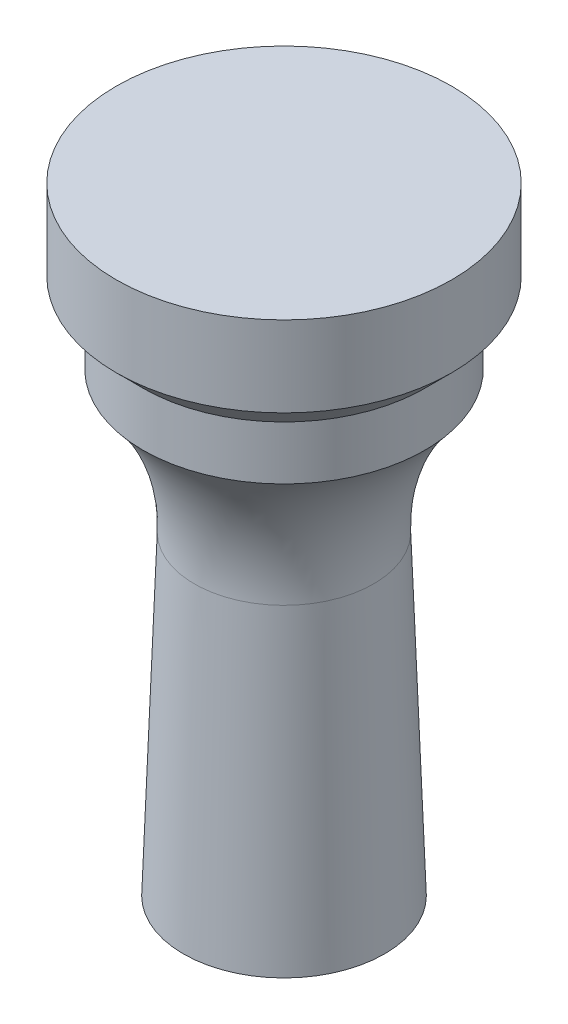
ISO-10303-21;
HEADER;
FILE_DESCRIPTION(('STEP AP214'),'2;1');
FILE_NAME('part.step','',(''),(''),'','','');
FILE_SCHEMA(('AUTOMOTIVE_DESIGN { 1 0 10303 214 1 1 1 1 }'));
ENDSEC;
DATA;
#1=APPLICATION_CONTEXT('core data for automotive mechanical design processes');
#2=APPLICATION_PROTOCOL_DEFINITION('international standard','automotive_design',2000,#1);
#3=PRODUCT_CONTEXT('',#1,'mechanical');
#4=PRODUCT('Part','Part','',(#3));
#5=PRODUCT_RELATED_PRODUCT_CATEGORY('part','',(#4));
#6=PRODUCT_DEFINITION_FORMATION('','',#4);
#7=PRODUCT_DEFINITION_CONTEXT('part definition',#1,'design');
#8=PRODUCT_DEFINITION('design','',#6,#7);
#9=PRODUCT_DEFINITION_SHAPE('','',#8);
#10=(LENGTH_UNIT() NAMED_UNIT(*) SI_UNIT(.MILLI.,.METRE.));
#11=(NAMED_UNIT(*) PLANE_ANGLE_UNIT() SI_UNIT($,.RADIAN.));
#12=(NAMED_UNIT(*) SI_UNIT($,.STERADIAN.) SOLID_ANGLE_UNIT());
#13=UNCERTAINTY_MEASURE_WITH_UNIT(LENGTH_MEASURE(1.E-05),#10,'distance_accuracy_value','');
#14=(GEOMETRIC_REPRESENTATION_CONTEXT(3) GLOBAL_UNCERTAINTY_ASSIGNED_CONTEXT((#13)) GLOBAL_UNIT_ASSIGNED_CONTEXT((#10,
#11,#12)) REPRESENTATION_CONTEXT('',''));
#15=CARTESIAN_POINT('',(0.,0.,0.));
#16=DIRECTION('',(0.,0.,1.));
#17=DIRECTION('',(1.,0.,0.));
#18=AXIS2_PLACEMENT_3D('',#15,#16,#17);
#19=CARTESIAN_POINT('',(0.,48.,0.));
#20=DIRECTION('',(0.,1.,0.));
#21=DIRECTION('',(0.,0.,1.));
#22=AXIS2_PLACEMENT_3D('',#19,#20,#21);
#23=PLANE('',#22);
#24=CARTESIAN_POINT('',(0.,48.,0.));
#25=DIRECTION('',(0.,-1.,0.));
#26=DIRECTION('',(0.,0.,-1.));
#27=AXIS2_PLACEMENT_3D('',#24,#25,#26);
#28=CIRCLE('',#27,12.5);
#29=CARTESIAN_POINT('',(0.,48.,-12.5));
#30=VERTEX_POINT('',#29);
#31=EDGE_CURVE('E11',#30,#30,#28,.T.);
#32=ORIENTED_EDGE('',*,*,#31,.F.);
#33=EDGE_LOOP('',(#32));
#34=FACE_BOUND('',#33,.T.);
#35=ADVANCED_FACE('F33',(#34),#23,.T.);
#36=CARTESIAN_POINT('',(0.,0.,0.));
#37=DIRECTION('',(0.,-1.,0.));
#38=DIRECTION('',(0.,0.,-1.));
#39=AXIS2_PLACEMENT_3D('',#36,#37,#38);
#40=CYLINDRICAL_SURFACE('',#39,12.5);
#41=ORIENTED_EDGE('',*,*,#31,.T.);
#42=EDGE_LOOP('',(#41));
#43=FACE_BOUND('',#42,.T.);
#44=CARTESIAN_POINT('',(0.,42.,0.));
#45=DIRECTION('',(0.,-1.,0.));
#46=DIRECTION('',(0.,0.,-1.));
#47=AXIS2_PLACEMENT_3D('',#44,#45,#46);
#48=CIRCLE('',#47,12.5);
#49=CARTESIAN_POINT('',(0.,42.,-12.5));
#50=VERTEX_POINT('',#49);
#51=EDGE_CURVE('E39',#50,#50,#48,.T.);
#52=ORIENTED_EDGE('',*,*,#51,.F.);
#53=EDGE_LOOP('',(#52));
#54=FACE_BOUND('',#53,.T.);
#55=ADVANCED_FACE('F55',(#43,#54),#40,.T.);
#56=CARTESIAN_POINT('',(0.,40.,0.));
#57=DIRECTION('',(0.,1.,0.));
#58=DIRECTION('',(0.,0.,1.));
#59=AXIS2_PLACEMENT_3D('',#56,#57,#58);
#60=CONICAL_SURFACE('',#59,10.5,0.78539816339745);
#61=ORIENTED_EDGE('',*,*,#51,.T.);
#62=EDGE_LOOP('',(#61));
#63=FACE_BOUND('',#62,.T.);
#64=CARTESIAN_POINT('',(0.,40.,0.));
#65=DIRECTION('',(0.,-1.,0.));
#66=DIRECTION('',(0.,0.,-1.));
#67=AXIS2_PLACEMENT_3D('',#64,#65,#66);
#68=CIRCLE('',#67,10.5);
#69=CARTESIAN_POINT('',(0.,40.,-10.5));
#70=VERTEX_POINT('',#69);
#71=EDGE_CURVE('E67',#70,#70,#68,.T.);
#72=ORIENTED_EDGE('',*,*,#71,.F.);
#73=EDGE_LOOP('',(#72));
#74=FACE_BOUND('',#73,.T.);
#75=ADVANCED_FACE('F60',(#63,#74),#60,.T.);
#76=CARTESIAN_POINT('',(0.,0.,0.));
#77=DIRECTION('',(0.,-1.,0.));
#78=DIRECTION('',(0.,0.,-1.));
#79=AXIS2_PLACEMENT_3D('',#76,#77,#78);
#80=CYLINDRICAL_SURFACE('',#79,10.5);
#81=ORIENTED_EDGE('',*,*,#71,.T.);
#82=EDGE_LOOP('',(#81));
#83=FACE_BOUND('',#82,.T.);
#84=CARTESIAN_POINT('',(0.,36.,0.));
#85=DIRECTION('',(0.,-1.,0.));
#86=DIRECTION('',(0.,0.,-1.));
#87=AXIS2_PLACEMENT_3D('',#84,#85,#86);
#88=CIRCLE('',#87,10.5);
#89=CARTESIAN_POINT('',(0.,36.,-10.5));
#90=VERTEX_POINT('',#89);
#91=EDGE_CURVE('E69',#90,#90,#88,.T.);
#92=ORIENTED_EDGE('',*,*,#91,.F.);
#93=EDGE_LOOP('',(#92));
#94=FACE_BOUND('',#93,.T.);
#95=ADVANCED_FACE('F92',(#83,#94),#80,.T.);
#96=CARTESIAN_POINT('',(0.,25.9900068156351,0.));
#97=DIRECTION('',(0.,-1.,0.));
#98=DIRECTION('',(0.,0.,-1.));
#99=AXIS2_PLACEMENT_3D('',#96,#97,#98);
#100=TOROIDAL_SURFACE('',#99,21.6713936663681,15.);
#101=ORIENTED_EDGE('',*,*,#91,.T.);
#102=EDGE_LOOP('',(#101));
#103=FACE_BOUND('',#102,.T.);
#104=CARTESIAN_POINT('',(0.,25.4665143650976,0.));
#105=DIRECTION('',(0.,-1.,0.));
#106=DIRECTION('',(0.,0.,-1.));
#107=AXIS2_PLACEMENT_3D('',#104,#105,#106);
#108=CIRCLE('',#107,6.68053126108162);
#109=CARTESIAN_POINT('',(0.,25.4665143650976,-6.68053126108162));
#110=VERTEX_POINT('',#109);
#111=EDGE_CURVE('E74',#110,#110,#108,.T.);
#112=ORIENTED_EDGE('',*,*,#111,.F.);
#113=EDGE_LOOP('',(#112));
#114=FACE_BOUND('',#113,.T.);
#115=ADVANCED_FACE('F86',(#103,#114),#100,.F.);
#116=CARTESIAN_POINT('',(0.,2.,0.));
#117=DIRECTION('',(0.,-1.,0.));
#118=DIRECTION('',(0.,0.,-1.));
#119=AXIS2_PLACEMENT_3D('',#116,#117,#118);
#120=CONICAL_SURFACE('',#119,7.5,0.0349065850398872);
#121=ORIENTED_EDGE('',*,*,#111,.T.);
#122=EDGE_LOOP('',(#121));
#123=FACE_BOUND('',#122,.T.);
#124=CARTESIAN_POINT('',(0.,2.,0.));
#125=DIRECTION('',(0.,-1.,0.));
#126=DIRECTION('',(0.,0.,-1.));
#127=AXIS2_PLACEMENT_3D('',#124,#125,#126);
#128=CIRCLE('',#127,7.5);
#129=CARTESIAN_POINT('',(0.,2.,-7.5));
#130=VERTEX_POINT('',#129);
#131=EDGE_CURVE('E77',#130,#130,#128,.T.);
#132=ORIENTED_EDGE('',*,*,#131,.F.);
#133=EDGE_LOOP('',(#132));
#134=FACE_BOUND('',#133,.T.);
#135=ADVANCED_FACE('F50',(#123,#134),#120,.T.);
#136=CARTESIAN_POINT('',(2.00000000000001,2.,0.));
#137=DIRECTION('',(0.,-1.,0.));
#138=DIRECTION('',(0.,0.,-1.));
#139=AXIS2_PLACEMENT_3D('',#136,#137,#138);
#140=PLANE('',#139);
#141=ORIENTED_EDGE('',*,*,#131,.T.);
#142=EDGE_LOOP('',(#141));
#143=FACE_BOUND('',#142,.T.);
#144=CARTESIAN_POINT('',(0.,2.,0.));
#145=DIRECTION('',(0.,-1.,0.));
#146=DIRECTION('',(0.,0.,-1.));
#147=AXIS2_PLACEMENT_3D('',#144,#145,#146);
#148=CIRCLE('',#147,2.00000000000001);
#149=CARTESIAN_POINT('',(0.,2.,-2.00000000000001));
#150=VERTEX_POINT('',#149);
#151=EDGE_CURVE('E80',#150,#150,#148,.T.);
#152=ORIENTED_EDGE('',*,*,#151,.F.);
#153=EDGE_LOOP('',(#152));
#154=FACE_BOUND('',#153,.T.);
#155=ADVANCED_FACE('F44',(#143,#154),#140,.T.);
#156=CARTESIAN_POINT('',(0.,0.,0.));
#157=DIRECTION('',(0.,1.,0.));
#158=DIRECTION('',(0.,0.,1.));
#159=AXIS2_PLACEMENT_3D('',#156,#157,#158);
#160=CONICAL_SURFACE('',#159,0.,0.78539816339745);
#161=ORIENTED_EDGE('',*,*,#151,.T.);
#162=EDGE_LOOP('',(#161));
#163=FACE_BOUND('',#162,.T.);
#164=CARTESIAN_POINT('',(0.,0.,0.));
#165=VERTEX_POINT('',#164);
#166=VERTEX_LOOP('',#165);
#167=FACE_BOUND('',#166,.T.);
#168=ADVANCED_FACE('F42',(#163,#167),#160,.T.);
#169=CLOSED_SHELL('',(#35,#55,#75,#95,#115,#135,#155,#168));
#170=MANIFOLD_SOLID_BREP('B2',#169);
#171=ADVANCED_BREP_SHAPE_REPRESENTATION('',(#18,#170),#14);
#172=SHAPE_DEFINITION_REPRESENTATION(#9,#171);
ENDSEC;
END-ISO-10303-21;
